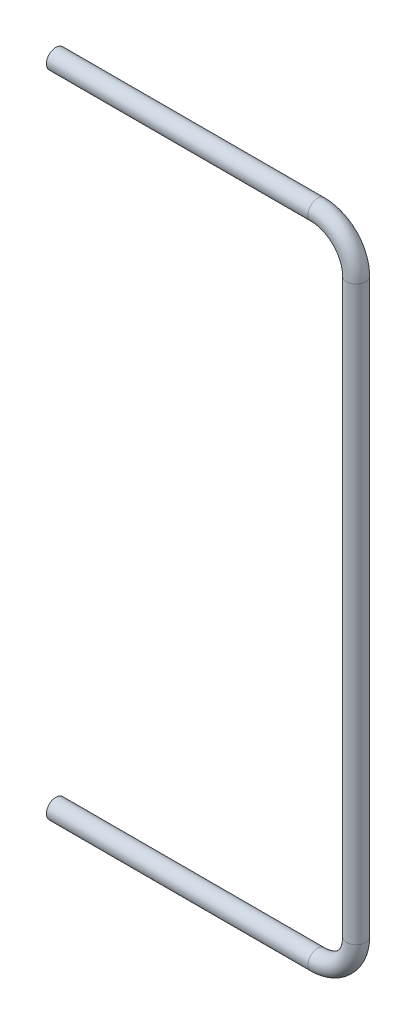
ISO-10303-21;
HEADER;
FILE_DESCRIPTION(('STEP AP214'),'2;1');
FILE_NAME('part.step','',(''),(''),'','','');
FILE_SCHEMA(('AUTOMOTIVE_DESIGN { 1 0 10303 214 1 1 1 1 }'));
ENDSEC;
DATA;
#1=APPLICATION_CONTEXT('core data for automotive mechanical design processes');
#2=APPLICATION_PROTOCOL_DEFINITION('international standard','automotive_design',2000,#1);
#3=PRODUCT_CONTEXT('',#1,'mechanical');
#4=PRODUCT('Part','Part','',(#3));
#5=PRODUCT_RELATED_PRODUCT_CATEGORY('part','',(#4));
#6=PRODUCT_DEFINITION_FORMATION('','',#4);
#7=PRODUCT_DEFINITION_CONTEXT('part definition',#1,'design');
#8=PRODUCT_DEFINITION('design','',#6,#7);
#9=PRODUCT_DEFINITION_SHAPE('','',#8);
#10=(LENGTH_UNIT() NAMED_UNIT(*) SI_UNIT(.MILLI.,.METRE.));
#11=(NAMED_UNIT(*) PLANE_ANGLE_UNIT() SI_UNIT($,.RADIAN.));
#12=(NAMED_UNIT(*) SI_UNIT($,.STERADIAN.) SOLID_ANGLE_UNIT());
#13=UNCERTAINTY_MEASURE_WITH_UNIT(LENGTH_MEASURE(1.E-05),#10,'distance_accuracy_value','');
#14=(GEOMETRIC_REPRESENTATION_CONTEXT(3) GLOBAL_UNCERTAINTY_ASSIGNED_CONTEXT((#13)) GLOBAL_UNIT_ASSIGNED_CONTEXT((#10,
#11,#12)) REPRESENTATION_CONTEXT('',''));
#15=CARTESIAN_POINT('',(0.,0.,0.));
#16=DIRECTION('',(0.,0.,1.));
#17=DIRECTION('',(1.,0.,0.));
#18=AXIS2_PLACEMENT_3D('',#15,#16,#17);
#19=CARTESIAN_POINT('',(-48.5118790773521,919.489731234543,0.));
#20=DIRECTION('',(0.,-1.,0.));
#21=DIRECTION('',(1.,0.,0.));
#22=AXIS2_PLACEMENT_3D('',#19,#20,#21);
#23=CYLINDRICAL_SURFACE('',#22,13.3223);
#24=CARTESIAN_POINT('',(-48.5118790773522,-80.5717687654577,0.));
#25=DIRECTION('',(0.,-1.,0.));
#26=DIRECTION('',(1.,0.,0.));
#27=AXIS2_PLACEMENT_3D('',#24,#25,#26);
#28=CIRCLE('',#27,13.3223);
#29=CARTESIAN_POINT('',(-35.1895790773522,-80.5717687654577,0.));
#30=VERTEX_POINT('',#29);
#31=EDGE_CURVE('E68',#30,#30,#28,.T.);
#32=ORIENTED_EDGE('',*,*,#31,.T.);
#33=EDGE_LOOP('',(#32));
#34=FACE_BOUND('',#33,.T.);
#35=CARTESIAN_POINT('',(-48.5118790773514,919.489731234543,1.12718431222848E-13));
#36=DIRECTION('',(0.,-1.,0.));
#37=DIRECTION('',(1.,0.,0.));
#38=AXIS2_PLACEMENT_3D('',#35,#36,#37);
#39=CIRCLE('',#38,13.3223);
#40=CARTESIAN_POINT('',(-35.1895790773514,919.489731234543,0.));
#41=VERTEX_POINT('',#40);
#42=EDGE_CURVE('E88',#41,#41,#39,.F.);
#43=ORIENTED_EDGE('',*,*,#42,.T.);
#44=EDGE_LOOP('',(#43));
#45=FACE_BOUND('',#44,.T.);
#46=ADVANCED_FACE('F15',(#34,#45),#23,.F.);
#47=CARTESIAN_POINT('',(-116.012379077353,919.489731234542,3.81767588904115E-13));
#48=DIRECTION('',(0.,0.,-1.));
#49=DIRECTION('',(-1.,0.,0.));
#50=AXIS2_PLACEMENT_3D('',#47,#48,#49);
#51=TOROIDAL_SURFACE('',#50,67.5005000000016,13.3223);
#52=CARTESIAN_POINT('',(-116.012379077352,986.990231234543,0.));
#53=DIRECTION('',(1.,0.,0.));
#54=DIRECTION('',(0.,0.,-1.));
#55=AXIS2_PLACEMENT_3D('',#52,#53,#54);
#56=CIRCLE('',#55,13.3223);
#57=CARTESIAN_POINT('',(-116.012379077352,986.990231234543,-13.3223));
#58=VERTEX_POINT('',#57);
#59=EDGE_CURVE('E63',#58,#58,#56,.F.);
#60=ORIENTED_EDGE('',*,*,#59,.T.);
#61=EDGE_LOOP('',(#60));
#62=FACE_BOUND('',#61,.T.);
#63=ORIENTED_EDGE('',*,*,#42,.F.);
#64=EDGE_LOOP('',(#63));
#65=FACE_BOUND('',#64,.T.);
#66=ADVANCED_FACE('F79',(#62,#65),#51,.F.);
#67=CARTESIAN_POINT('',(-116.012379077352,-80.5717687654578,0.));
#68=DIRECTION('',(0.,0.,-1.));
#69=DIRECTION('',(-1.,0.,0.));
#70=AXIS2_PLACEMENT_3D('',#67,#68,#69);
#71=TOROIDAL_SURFACE('',#70,67.5004999999998,13.3223);
#72=ORIENTED_EDGE('',*,*,#31,.F.);
#73=EDGE_LOOP('',(#72));
#74=FACE_BOUND('',#73,.T.);
#75=CARTESIAN_POINT('',(-116.012379077352,-148.072268765458,0.));
#76=DIRECTION('',(-1.,0.,0.));
#77=DIRECTION('',(0.,-1.,0.));
#78=AXIS2_PLACEMENT_3D('',#75,#76,#77);
#79=CIRCLE('',#78,13.3223);
#80=CARTESIAN_POINT('',(-116.012379077352,-161.394568765458,0.));
#81=VERTEX_POINT('',#80);
#82=EDGE_CURVE('E60',#81,#81,#79,.T.);
#83=ORIENTED_EDGE('',*,*,#82,.T.);
#84=EDGE_LOOP('',(#83));
#85=FACE_BOUND('',#84,.T.);
#86=ADVANCED_FACE('F75',(#74,#85),#71,.F.);
#87=CARTESIAN_POINT('',(-573.212379077351,986.990231234543,0.));
#88=DIRECTION('',(1.,0.,0.));
#89=DIRECTION('',(0.,0.,-1.));
#90=AXIS2_PLACEMENT_3D('',#87,#88,#89);
#91=CYLINDRICAL_SURFACE('',#90,13.3223);
#92=ORIENTED_EDGE('',*,*,#59,.F.);
#93=EDGE_LOOP('',(#92));
#94=FACE_BOUND('',#93,.T.);
#95=CARTESIAN_POINT('',(-573.212379077351,986.990231234543,0.));
#96=DIRECTION('',(1.,0.,0.));
#97=DIRECTION('',(0.,0.,-1.));
#98=AXIS2_PLACEMENT_3D('',#95,#96,#97);
#99=CIRCLE('',#98,13.3223);
#100=CARTESIAN_POINT('',(-573.212379077351,986.990231234543,-13.3223));
#101=VERTEX_POINT('',#100);
#102=EDGE_CURVE('E18',#101,#101,#99,.T.);
#103=ORIENTED_EDGE('',*,*,#102,.F.);
#104=EDGE_LOOP('',(#103));
#105=FACE_BOUND('',#104,.T.);
#106=ADVANCED_FACE('F78',(#94,#105),#91,.F.);
#107=CARTESIAN_POINT('',(-116.012379077352,-148.072268765458,0.));
#108=DIRECTION('',(-1.,0.,0.));
#109=DIRECTION('',(0.,-1.,0.));
#110=AXIS2_PLACEMENT_3D('',#107,#108,#109);
#111=CYLINDRICAL_SURFACE('',#110,13.3223);
#112=CARTESIAN_POINT('',(-573.212379077351,-148.072268765458,0.));
#113=DIRECTION('',(-1.,0.,0.));
#114=DIRECTION('',(0.,-1.,0.));
#115=AXIS2_PLACEMENT_3D('',#112,#113,#114);
#116=CIRCLE('',#115,13.3223);
#117=CARTESIAN_POINT('',(-573.212379077351,-161.394568765458,0.));
#118=VERTEX_POINT('',#117);
#119=EDGE_CURVE('E97',#118,#118,#116,.T.);
#120=ORIENTED_EDGE('',*,*,#119,.T.);
#121=EDGE_LOOP('',(#120));
#122=FACE_BOUND('',#121,.T.);
#123=ORIENTED_EDGE('',*,*,#82,.F.);
#124=EDGE_LOOP('',(#123));
#125=FACE_BOUND('',#124,.T.);
#126=ADVANCED_FACE('F108',(#122,#125),#111,.F.);
#127=CARTESIAN_POINT('',(-573.212379077351,986.990231234543,0.));
#128=DIRECTION('',(-1.,0.,0.));
#129=DIRECTION('',(0.,0.,1.));
#130=AXIS2_PLACEMENT_3D('',#127,#128,#129);
#131=PLANE('',#130);
#132=ORIENTED_EDGE('',*,*,#102,.T.);
#133=EDGE_LOOP('',(#132));
#134=FACE_BOUND('',#133,.T.);
#135=CARTESIAN_POINT('',(-573.212379077351,986.990231234543,0.));
#136=DIRECTION('',(1.,0.,0.));
#137=DIRECTION('',(0.,0.,-1.));
#138=AXIS2_PLACEMENT_3D('',#135,#136,#137);
#139=CIRCLE('',#138,16.7005);
#140=CARTESIAN_POINT('',(-573.212379077351,986.990231234543,-16.7005));
#141=VERTEX_POINT('',#140);
#142=EDGE_CURVE('E95',#141,#141,#139,.T.);
#143=ORIENTED_EDGE('',*,*,#142,.F.);
#144=EDGE_LOOP('',(#143));
#145=FACE_BOUND('',#144,.T.);
#146=ADVANCED_FACE('F104',(#134,#145),#131,.T.);
#147=CARTESIAN_POINT('',(-573.212379077351,-148.072268765458,0.));
#148=DIRECTION('',(1.,0.,0.));
#149=DIRECTION('',(0.,0.,-1.));
#150=AXIS2_PLACEMENT_3D('',#147,#148,#149);
#151=PLANE('',#150);
#152=ORIENTED_EDGE('',*,*,#119,.F.);
#153=EDGE_LOOP('',(#152));
#154=FACE_BOUND('',#153,.T.);
#155=CARTESIAN_POINT('',(-573.212379077351,-148.072268765458,0.));
#156=DIRECTION('',(-1.,0.,0.));
#157=DIRECTION('',(0.,-1.,0.));
#158=AXIS2_PLACEMENT_3D('',#155,#156,#157);
#159=CIRCLE('',#158,16.7005);
#160=CARTESIAN_POINT('',(-573.212379077351,-164.772768765458,0.));
#161=VERTEX_POINT('',#160);
#162=EDGE_CURVE('E57',#161,#161,#159,.F.);
#163=ORIENTED_EDGE('',*,*,#162,.F.);
#164=EDGE_LOOP('',(#163));
#165=FACE_BOUND('',#164,.T.);
#166=ADVANCED_FACE('F144',(#154,#165),#151,.F.);
#167=CARTESIAN_POINT('',(-573.212379077351,986.990231234543,0.));
#168=DIRECTION('',(1.,0.,0.));
#169=DIRECTION('',(0.,0.,-1.));
#170=AXIS2_PLACEMENT_3D('',#167,#168,#169);
#171=CYLINDRICAL_SURFACE('',#170,16.7005);
#172=CARTESIAN_POINT('',(-116.012379077352,986.990231234544,1.85392825153118E-13));
#173=DIRECTION('',(1.,0.,0.));
#174=DIRECTION('',(0.,1.,0.));
#175=AXIS2_PLACEMENT_3D('',#172,#173,#174);
#176=CIRCLE('',#175,16.7005000000001);
#177=CARTESIAN_POINT('',(-116.012379077351,1003.69073123454,-1.24575164331768E-13));
#178=VERTEX_POINT('',#177);
#179=EDGE_CURVE('E54',#178,#178,#176,.T.);
#180=ORIENTED_EDGE('',*,*,#179,.F.);
#181=EDGE_LOOP('',(#180));
#182=FACE_BOUND('',#181,.T.);
#183=ORIENTED_EDGE('',*,*,#142,.T.);
#184=EDGE_LOOP('',(#183));
#185=FACE_BOUND('',#184,.T.);
#186=ADVANCED_FACE('F137',(#182,#185),#171,.T.);
#187=CARTESIAN_POINT('',(-116.012379077352,-148.072268765458,0.));
#188=DIRECTION('',(-1.,0.,0.));
#189=DIRECTION('',(0.,-1.,0.));
#190=AXIS2_PLACEMENT_3D('',#187,#188,#189);
#191=CYLINDRICAL_SURFACE('',#190,16.7005);
#192=ORIENTED_EDGE('',*,*,#162,.T.);
#193=EDGE_LOOP('',(#192));
#194=FACE_BOUND('',#193,.T.);
#195=CARTESIAN_POINT('',(-116.012379077352,-148.072268765458,1.6958168100902E-13));
#196=DIRECTION('',(-1.,0.,0.));
#197=DIRECTION('',(0.,-1.,0.));
#198=AXIS2_PLACEMENT_3D('',#195,#196,#197);
#199=CIRCLE('',#198,16.7005);
#200=CARTESIAN_POINT('',(-116.012379077352,-164.772768765458,0.));
#201=VERTEX_POINT('',#200);
#202=EDGE_CURVE('E27',#201,#201,#199,.F.);
#203=ORIENTED_EDGE('',*,*,#202,.F.);
#204=EDGE_LOOP('',(#203));
#205=FACE_BOUND('',#204,.T.);
#206=ADVANCED_FACE('F48',(#194,#205),#191,.T.);
#207=CARTESIAN_POINT('',(-116.012379077353,919.489731234542,1.43822922371753E-12));
#208=DIRECTION('',(0.,0.,-1.));
#209=DIRECTION('',(-1.,0.,0.));
#210=AXIS2_PLACEMENT_3D('',#207,#208,#209);
#211=TOROIDAL_SURFACE('',#210,67.5005000000016,16.7005000000001);
#212=ORIENTED_EDGE('',*,*,#179,.T.);
#213=EDGE_LOOP('',(#212));
#214=FACE_BOUND('',#213,.T.);
#215=CARTESIAN_POINT('',(-48.5118790773521,919.489731234543,0.));
#216=DIRECTION('',(0.,-1.,0.));
#217=DIRECTION('',(1.,0.,0.));
#218=AXIS2_PLACEMENT_3D('',#215,#216,#217);
#219=CIRCLE('',#218,16.7005);
#220=CARTESIAN_POINT('',(-31.8113790773521,919.489731234543,0.));
#221=VERTEX_POINT('',#220);
#222=EDGE_CURVE('E22',#221,#221,#219,.T.);
#223=ORIENTED_EDGE('',*,*,#222,.F.);
#224=EDGE_LOOP('',(#223));
#225=FACE_BOUND('',#224,.T.);
#226=ADVANCED_FACE('F43',(#214,#225),#211,.T.);
#227=CARTESIAN_POINT('',(-116.012379077352,-80.5717687654574,5.82802012262399E-13));
#228=DIRECTION('',(0.,0.,-1.));
#229=DIRECTION('',(-1.,0.,0.));
#230=AXIS2_PLACEMENT_3D('',#227,#228,#229);
#231=TOROIDAL_SURFACE('',#230,67.5005000000004,16.7005);
#232=CARTESIAN_POINT('',(-48.511879077352,-80.5717687654578,0.));
#233=DIRECTION('',(0.,-1.,0.));
#234=DIRECTION('',(1.,0.,0.));
#235=AXIS2_PLACEMENT_3D('',#232,#233,#234);
#236=CIRCLE('',#235,16.7005);
#237=CARTESIAN_POINT('',(-31.811379077352,-80.5717687654578,0.));
#238=VERTEX_POINT('',#237);
#239=EDGE_CURVE('E10',#238,#238,#236,.F.);
#240=ORIENTED_EDGE('',*,*,#239,.F.);
#241=EDGE_LOOP('',(#240));
#242=FACE_BOUND('',#241,.T.);
#243=ORIENTED_EDGE('',*,*,#202,.T.);
#244=EDGE_LOOP('',(#243));
#245=FACE_BOUND('',#244,.T.);
#246=ADVANCED_FACE('F38',(#242,#245),#231,.T.);
#247=CARTESIAN_POINT('',(-48.5118790773521,919.489731234543,0.));
#248=DIRECTION('',(0.,-1.,0.));
#249=DIRECTION('',(1.,0.,0.));
#250=AXIS2_PLACEMENT_3D('',#247,#248,#249);
#251=CYLINDRICAL_SURFACE('',#250,16.7005);
#252=ORIENTED_EDGE('',*,*,#239,.T.);
#253=EDGE_LOOP('',(#252));
#254=FACE_BOUND('',#253,.T.);
#255=ORIENTED_EDGE('',*,*,#222,.T.);
#256=EDGE_LOOP('',(#255));
#257=FACE_BOUND('',#256,.T.);
#258=ADVANCED_FACE('F42',(#254,#257),#251,.T.);
#259=CLOSED_SHELL('',(#46,#66,#86,#106,#126,#146,#166,#186,#206,#226,#246,#258));
#260=MANIFOLD_SOLID_BREP('B1',#259);
#261=ADVANCED_BREP_SHAPE_REPRESENTATION('',(#18,#260),#14);
#262=SHAPE_DEFINITION_REPRESENTATION(#9,#261);
ENDSEC;
END-ISO-10303-21;
